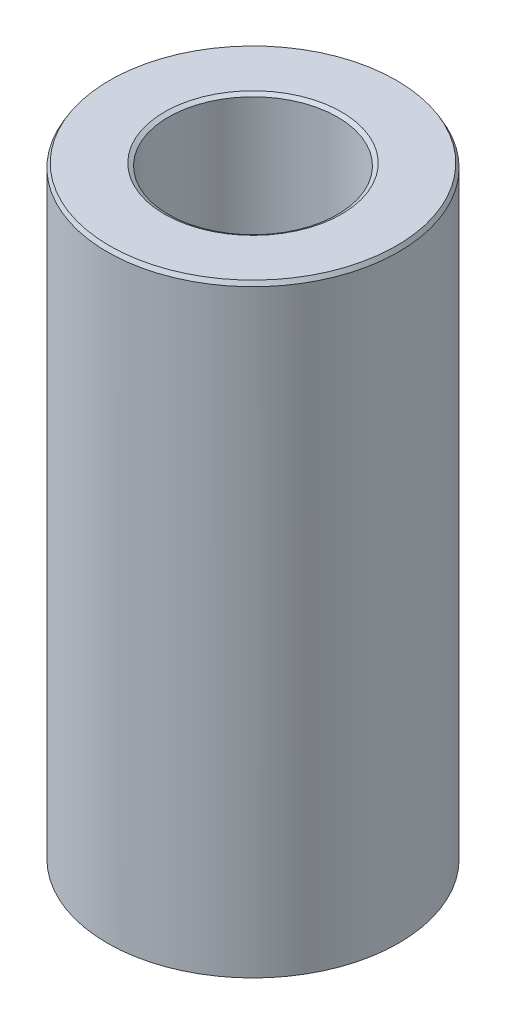
ISO-10303-21;
HEADER;
FILE_DESCRIPTION(('STEP AP214'),'2;1');
FILE_NAME('part.step','',(''),(''),'','','');
FILE_SCHEMA(('AUTOMOTIVE_DESIGN { 1 0 10303 214 1 1 1 1 }'));
ENDSEC;
DATA;
#1=APPLICATION_CONTEXT('core data for automotive mechanical design processes');
#2=APPLICATION_PROTOCOL_DEFINITION('international standard','automotive_design',2000,#1);
#3=PRODUCT_CONTEXT('',#1,'mechanical');
#4=PRODUCT('Part','Part','',(#3));
#5=PRODUCT_RELATED_PRODUCT_CATEGORY('part','',(#4));
#6=PRODUCT_DEFINITION_FORMATION('','',#4);
#7=PRODUCT_DEFINITION_CONTEXT('part definition',#1,'design');
#8=PRODUCT_DEFINITION('design','',#6,#7);
#9=PRODUCT_DEFINITION_SHAPE('','',#8);
#10=(LENGTH_UNIT() NAMED_UNIT(*) SI_UNIT(.MILLI.,.METRE.));
#11=(NAMED_UNIT(*) PLANE_ANGLE_UNIT() SI_UNIT($,.RADIAN.));
#12=(NAMED_UNIT(*) SI_UNIT($,.STERADIAN.) SOLID_ANGLE_UNIT());
#13=UNCERTAINTY_MEASURE_WITH_UNIT(LENGTH_MEASURE(1.E-05),#10,'distance_accuracy_value','');
#14=(GEOMETRIC_REPRESENTATION_CONTEXT(3) GLOBAL_UNCERTAINTY_ASSIGNED_CONTEXT((#13)) GLOBAL_UNIT_ASSIGNED_CONTEXT((#10,
#11,#12)) REPRESENTATION_CONTEXT('',''));
#15=CARTESIAN_POINT('',(0.,0.,0.));
#16=DIRECTION('',(0.,0.,1.));
#17=DIRECTION('',(1.,0.,0.));
#18=AXIS2_PLACEMENT_3D('',#15,#16,#17);
#19=CARTESIAN_POINT('',(0.,166.058418449914,0.));
#20=DIRECTION('',(0.,-1.,0.));
#21=DIRECTION('',(0.,0.,-1.));
#22=AXIS2_PLACEMENT_3D('',#19,#20,#21);
#23=CYLINDRICAL_SURFACE('',#22,40.);
#24=CARTESIAN_POINT('',(0.,0.644402574227404,0.));
#25=DIRECTION('',(0.,1.,0.));
#26=DIRECTION('',(0.,0.,1.));
#27=AXIS2_PLACEMENT_3D('',#24,#25,#26);
#28=CIRCLE('',#27,40.);
#29=CARTESIAN_POINT('',(0.,0.644402574227404,-40.));
#30=VERTEX_POINT('',#29);
#31=EDGE_CURVE('E10',#30,#30,#28,.T.);
#32=CARTESIAN_POINT('',(0.,164.942280450824,0.));
#33=DIRECTION('',(0.,1.,0.));
#34=DIRECTION('',(0.,0.,1.));
#35=AXIS2_PLACEMENT_3D('',#32,#33,#34);
#36=CIRCLE('',#35,40.);
#37=CARTESIAN_POINT('',(0.,164.942280450824,-40.));
#38=VERTEX_POINT('',#37);
#39=EDGE_CURVE('E50',#38,#38,#36,.F.);
#40=CARTESIAN_POINT('',(0.,0.644402574227404,-40.));
#41=CARTESIAN_POINT('',(0.,2.35583880210862,-40.));
#42=CARTESIAN_POINT('',(0.,4.06727502998984,-40.));
#43=CARTESIAN_POINT('',(0.,7.49014748575227,-40.));
#44=CARTESIAN_POINT('',(0.,9.2015837136335,-40.));
#45=CARTESIAN_POINT('',(0.,12.6244561693959,-40.));
#46=CARTESIAN_POINT('',(0.,14.3358923972772,-40.));
#47=CARTESIAN_POINT('',(0.,17.7587648530396,-40.));
#48=CARTESIAN_POINT('',(0.,19.4702010809208,-40.));
#49=CARTESIAN_POINT('',(0.,22.8930735366832,-40.));
#50=CARTESIAN_POINT('',(0.,24.6045097645644,-40.));
#51=CARTESIAN_POINT('',(0.,28.0273822203269,-40.));
#52=CARTESIAN_POINT('',(0.,29.7388184482081,-40.));
#53=CARTESIAN_POINT('',(0.,33.1616909039706,-40.));
#54=CARTESIAN_POINT('',(0.,34.8731271318518,-40.));
#55=CARTESIAN_POINT('',(0.,38.2959995876142,-40.));
#56=CARTESIAN_POINT('',(0.,40.0074358154954,-40.));
#57=CARTESIAN_POINT('',(0.,43.4303082712578,-40.));
#58=CARTESIAN_POINT('',(0.,45.1417444991391,-40.));
#59=CARTESIAN_POINT('',(0.,48.5646169549015,-40.));
#60=CARTESIAN_POINT('',(0.,50.2760531827827,-40.));
#61=CARTESIAN_POINT('',(0.,53.6989256385451,-40.));
#62=CARTESIAN_POINT('',(0.,55.4103618664264,-40.));
#63=CARTESIAN_POINT('',(0.,58.8332343221888,-40.));
#64=CARTESIAN_POINT('',(0.,60.54467055007,-40.));
#65=CARTESIAN_POINT('',(0.,63.9675430058324,-40.));
#66=CARTESIAN_POINT('',(0.,65.6789792337137,-40.));
#67=CARTESIAN_POINT('',(0.,69.1018516894761,-40.));
#68=CARTESIAN_POINT('',(0.,70.8132879173573,-40.));
#69=CARTESIAN_POINT('',(0.,74.2361603731198,-40.));
#70=CARTESIAN_POINT('',(0.,75.947596601001,-40.));
#71=CARTESIAN_POINT('',(0.,79.3704690567634,-40.));
#72=CARTESIAN_POINT('',(0.,81.0819052846446,-40.));
#73=CARTESIAN_POINT('',(0.,84.5047777404071,-40.));
#74=CARTESIAN_POINT('',(0.,86.2162139682883,-40.));
#75=CARTESIAN_POINT('',(0.,89.6390864240507,-40.));
#76=CARTESIAN_POINT('',(0.,91.3505226519319,-40.));
#77=CARTESIAN_POINT('',(0.,94.7733951076944,-40.));
#78=CARTESIAN_POINT('',(0.,96.4848313355756,-40.));
#79=CARTESIAN_POINT('',(0.,99.907703791338,-40.));
#80=CARTESIAN_POINT('',(0.,101.619140019219,-40.));
#81=CARTESIAN_POINT('',(0.,105.042012474982,-40.));
#82=CARTESIAN_POINT('',(0.,106.753448702863,-40.));
#83=CARTESIAN_POINT('',(0.,110.176321158625,-40.));
#84=CARTESIAN_POINT('',(0.,111.887757386507,-40.));
#85=CARTESIAN_POINT('',(0.,115.310629842269,-40.));
#86=CARTESIAN_POINT('',(0.,117.02206607015,-40.));
#87=CARTESIAN_POINT('',(0.,120.444938525913,-40.));
#88=CARTESIAN_POINT('',(0.,122.156374753794,-40.));
#89=CARTESIAN_POINT('',(0.,125.579247209556,-40.));
#90=CARTESIAN_POINT('',(0.,127.290683437437,-40.));
#91=CARTESIAN_POINT('',(0.,130.7135558932,-40.));
#92=CARTESIAN_POINT('',(0.,132.424992121081,-40.));
#93=CARTESIAN_POINT('',(0.,135.847864576844,-40.));
#94=CARTESIAN_POINT('',(0.,137.559300804725,-40.));
#95=CARTESIAN_POINT('',(0.,140.982173260487,-40.));
#96=CARTESIAN_POINT('',(0.,142.693609488368,-40.));
#97=CARTESIAN_POINT('',(0.,146.116481944131,-40.));
#98=CARTESIAN_POINT('',(0.,147.827918172012,-40.));
#99=CARTESIAN_POINT('',(0.,151.250790627775,-40.));
#100=CARTESIAN_POINT('',(0.,152.962226855656,-40.));
#101=CARTESIAN_POINT('',(0.,156.385099311418,-40.));
#102=CARTESIAN_POINT('',(0.,158.096535539299,-40.));
#103=CARTESIAN_POINT('',(0.,161.519407995062,-40.));
#104=CARTESIAN_POINT('',(0.,163.230844222943,-40.));
#105=CARTESIAN_POINT('',(0.,164.942280450824,-40.));
#106=B_SPLINE_CURVE_WITH_KNOTS('',3,(#40,#41,#42,#43,#44,#45,#46,#47,#48,#49,#50,#51,#52,#53,
#54,#55,#56,#57,#58,#59,#60,#61,#62,#63,#64,#65,#66,#67,#68,#69,#70,#71,#72,#73,#74,#75,#76,#77,
#78,#79,#80,#81,#82,#83,#84,#85,#86,#87,#88,#89,#90,#91,#92,#93,#94,#95,#96,#97,#98,#99,#100,
#101,#102,#103,#104,#105),.UNSPECIFIED.,.F.,.F.,(4,2,2,2,2,2,2,2,2,2,2,2,2,2,2,2,2,2,2,2,2,2,2,
2,2,2,2,2,2,2,2,2,4),(0.,5.13430868364365,10.2686173672873,15.402926050931,20.5372347345746,
25.6715434182183,30.8058521018619,35.9401607855056,41.0744694691492,46.2087781527929,
51.3430868364365,56.4773955200802,61.6117042037238,66.7460128873675,71.8803215710111,
77.0146302546548,82.1489389382984,87.2832476219421,92.4175563055857,97.5518649892294,
102.686173672873,107.820482356517,112.95479104016,118.089099723804,123.223408407448,
128.357717091091,133.492025774735,138.626334458379,143.760643142022,148.894951825666,
154.02926050931,159.163569192953,164.297877876597),.UNSPECIFIED.);
#107=EDGE_CURVE('BSEAM39',#30,#38,#106,.T.);
#108=ORIENTED_EDGE('',*,*,#31,.T.);
#109=ORIENTED_EDGE('',*,*,#39,.T.);
#110=ORIENTED_EDGE('',*,*,#107,.T.);
#111=ORIENTED_EDGE('',*,*,#107,.F.);
#112=EDGE_LOOP('',(#108,#110,#109,#111));
#113=FACE_BOUND('',#112,.T.);
#114=ADVANCED_FACE('F39',(#113),#23,.T.);
#115=CARTESIAN_POINT('',(0.,166.058418449914,0.));
#116=DIRECTION('',(0.,1.,0.));
#117=DIRECTION('',(0.,0.,1.));
#118=AXIS2_PLACEMENT_3D('',#115,#116,#117);
#119=PLANE('',#118);
#120=CARTESIAN_POINT('',(0.,166.058418449914,0.));
#121=DIRECTION('',(0.,1.,0.));
#122=DIRECTION('',(0.,0.,1.));
#123=AXIS2_PLACEMENT_3D('',#120,#121,#122);
#124=CIRCLE('',#123,24.3085651649166);
#125=CARTESIAN_POINT('',(0.,166.058418449914,24.3085651649166));
#126=VERTEX_POINT('',#125);
#127=EDGE_CURVE('E58',#126,#126,#124,.F.);
#128=ORIENTED_EDGE('',*,*,#127,.T.);
#129=EDGE_LOOP('',(#128));
#130=FACE_BOUND('',#129,.T.);
#131=CARTESIAN_POINT('',(0.,166.058418449914,0.));
#132=DIRECTION('',(0.,1.,0.));
#133=DIRECTION('',(0.,0.,1.));
#134=AXIS2_PLACEMENT_3D('',#131,#132,#133);
#135=CIRCLE('',#134,39.3555974257728);
#136=CARTESIAN_POINT('',(0.,166.058418449914,39.3555974257728));
#137=VERTEX_POINT('',#136);
#138=EDGE_CURVE('E61',#137,#137,#135,.T.);
#139=ORIENTED_EDGE('',*,*,#138,.T.);
#140=EDGE_LOOP('',(#139));
#141=FACE_BOUND('',#140,.T.);
#142=ADVANCED_FACE('F88',(#130,#141),#119,.T.);
#143=CARTESIAN_POINT('',(0.,0.,0.));
#144=DIRECTION('',(0.,1.,0.));
#145=DIRECTION('',(0.,0.,1.));
#146=AXIS2_PLACEMENT_3D('',#143,#144,#145);
#147=PLANE('',#146);
#148=CARTESIAN_POINT('',(0.,0.,0.));
#149=DIRECTION('',(0.,1.,0.));
#150=DIRECTION('',(0.,0.,1.));
#151=AXIS2_PLACEMENT_3D('',#148,#149,#150);
#152=CIRCLE('',#151,23.8368297400539);
#153=CARTESIAN_POINT('',(0.,0.,23.8368297400539));
#154=VERTEX_POINT('',#153);
#155=EDGE_CURVE('E51',#154,#154,#152,.T.);
#156=ORIENTED_EDGE('',*,*,#155,.T.);
#157=EDGE_LOOP('',(#156));
#158=FACE_BOUND('',#157,.T.);
#159=CARTESIAN_POINT('',(0.,0.,0.));
#160=DIRECTION('',(0.,1.,0.));
#161=DIRECTION('',(0.,0.,1.));
#162=AXIS2_PLACEMENT_3D('',#159,#160,#161);
#163=CIRCLE('',#162,38.88386200091);
#164=CARTESIAN_POINT('',(0.,0.,38.88386200091));
#165=VERTEX_POINT('',#164);
#166=EDGE_CURVE('E54',#165,#165,#163,.F.);
#167=ORIENTED_EDGE('',*,*,#166,.T.);
#168=EDGE_LOOP('',(#167));
#169=FACE_BOUND('',#168,.T.);
#170=ADVANCED_FACE('F83',(#158,#169),#147,.F.);
#171=CARTESIAN_POINT('',(0.,166.058418449914,0.));
#172=DIRECTION('',(0.,-1.,0.));
#173=DIRECTION('',(0.,0.,-1.));
#174=AXIS2_PLACEMENT_3D('',#171,#172,#173);
#175=CYLINDRICAL_SURFACE('',#174,23.1924271658265);
#176=CARTESIAN_POINT('',(0.,165.414015875687,0.));
#177=DIRECTION('',(0.,1.,0.));
#178=DIRECTION('',(0.,0.,1.));
#179=AXIS2_PLACEMENT_3D('',#176,#177,#178);
#180=CIRCLE('',#179,23.1924271658265);
#181=CARTESIAN_POINT('',(0.,165.414015875687,-23.1924271658265));
#182=VERTEX_POINT('',#181);
#183=EDGE_CURVE('E67',#182,#182,#180,.T.);
#184=CARTESIAN_POINT('',(0.,1.11613799908991,0.));
#185=DIRECTION('',(0.,1.,0.));
#186=DIRECTION('',(0.,0.,1.));
#187=AXIS2_PLACEMENT_3D('',#184,#185,#186);
#188=CIRCLE('',#187,23.1924271658265);
#189=CARTESIAN_POINT('',(0.,1.11613799908991,-23.1924271658265));
#190=VERTEX_POINT('',#189);
#191=EDGE_CURVE('E69',#190,#190,#188,.F.);
#192=CARTESIAN_POINT('',(0.,165.414015875687,-23.1924271658265));
#193=CARTESIAN_POINT('',(0.,163.702579647805,-23.1924271658265));
#194=CARTESIAN_POINT('',(0.,161.991143419924,-23.1924271658265));
#195=CARTESIAN_POINT('',(0.,158.568270964162,-23.1924271658265));
#196=CARTESIAN_POINT('',(0.,156.856834736281,-23.1924271658265));
#197=CARTESIAN_POINT('',(0.,153.433962280518,-23.1924271658265));
#198=CARTESIAN_POINT('',(0.,151.722526052637,-23.1924271658265));
#199=CARTESIAN_POINT('',(0.,148.299653596874,-23.1924271658265));
#200=CARTESIAN_POINT('',(0.,146.588217368993,-23.1924271658265));
#201=CARTESIAN_POINT('',(0.,143.165344913231,-23.1924271658265));
#202=CARTESIAN_POINT('',(0.,141.45390868535,-23.1924271658265));
#203=CARTESIAN_POINT('',(0.,138.031036229587,-23.1924271658265));
#204=CARTESIAN_POINT('',(0.,136.319600001706,-23.1924271658265));
#205=CARTESIAN_POINT('',(0.,132.896727545944,-23.1924271658265));
#206=CARTESIAN_POINT('',(0.,131.185291318062,-23.1924271658265));
#207=CARTESIAN_POINT('',(0.,127.7624188623,-23.1924271658265));
#208=CARTESIAN_POINT('',(0.,126.050982634419,-23.1924271658265));
#209=CARTESIAN_POINT('',(0.,122.628110178656,-23.1924271658265));
#210=CARTESIAN_POINT('',(0.,120.916673950775,-23.1924271658265));
#211=CARTESIAN_POINT('',(0.,117.493801495013,-23.1924271658265));
#212=CARTESIAN_POINT('',(0.,115.782365267131,-23.1924271658265));
#213=CARTESIAN_POINT('',(0.,112.359492811369,-23.1924271658265));
#214=CARTESIAN_POINT('',(0.,110.648056583488,-23.1924271658265));
#215=CARTESIAN_POINT('',(0.,107.225184127725,-23.1924271658265));
#216=CARTESIAN_POINT('',(0.,105.513747899844,-23.1924271658265));
#217=CARTESIAN_POINT('',(0.,102.090875444082,-23.1924271658265));
#218=CARTESIAN_POINT('',(0.,100.3794392162,-23.1924271658265));
#219=CARTESIAN_POINT('',(0.,96.956566760438,-23.1924271658265));
#220=CARTESIAN_POINT('',(0.,95.2451305325568,-23.1924271658265));
#221=CARTESIAN_POINT('',(0.,91.8222580767944,-23.1924271658265));
#222=CARTESIAN_POINT('',(0.,90.1108218489131,-23.1924271658265));
#223=CARTESIAN_POINT('',(0.,86.6879493931507,-23.1924271658265));
#224=CARTESIAN_POINT('',(0.,84.9765131652695,-23.1924271658265));
#225=CARTESIAN_POINT('',(0.,81.5536407095071,-23.1924271658265));
#226=CARTESIAN_POINT('',(0.,79.8422044816259,-23.1924271658265));
#227=CARTESIAN_POINT('',(0.,76.4193320258634,-23.1924271658265));
#228=CARTESIAN_POINT('',(0.,74.7078957979822,-23.1924271658265));
#229=CARTESIAN_POINT('',(0.,71.2850233422198,-23.1924271658265));
#230=CARTESIAN_POINT('',(0.,69.5735871143386,-23.1924271658265));
#231=CARTESIAN_POINT('',(0.,66.1507146585761,-23.1924271658265));
#232=CARTESIAN_POINT('',(0.,64.4392784306949,-23.1924271658265));
#233=CARTESIAN_POINT('',(0.,61.0164059749325,-23.1924271658265));
#234=CARTESIAN_POINT('',(0.,59.3049697470513,-23.1924271658265));
#235=CARTESIAN_POINT('',(0.,55.8820972912888,-23.1924271658265));
#236=CARTESIAN_POINT('',(0.,54.1706610634076,-23.1924271658265));
#237=CARTESIAN_POINT('',(0.,50.7477886076452,-23.1924271658265));
#238=CARTESIAN_POINT('',(0.,49.036352379764,-23.1924271658265));
#239=CARTESIAN_POINT('',(0.,45.6134799240015,-23.1924271658265));
#240=CARTESIAN_POINT('',(0.,43.9020436961203,-23.1924271658265));
#241=CARTESIAN_POINT('',(0.,40.4791712403579,-23.1924271658265));
#242=CARTESIAN_POINT('',(0.,38.7677350124767,-23.1924271658265));
#243=CARTESIAN_POINT('',(0.,35.3448625567142,-23.1924271658265));
#244=CARTESIAN_POINT('',(0.,33.633426328833,-23.1924271658265));
#245=CARTESIAN_POINT('',(0.,30.2105538730706,-23.1924271658265));
#246=CARTESIAN_POINT('',(0.,28.4991176451894,-23.1924271658265));
#247=CARTESIAN_POINT('',(0.,25.0762451894269,-23.1924271658265));
#248=CARTESIAN_POINT('',(0.,23.3648089615457,-23.1924271658265));
#249=CARTESIAN_POINT('',(0.,19.9419365057833,-23.1924271658265));
#250=CARTESIAN_POINT('',(0.,18.2305002779021,-23.1924271658265));
#251=CARTESIAN_POINT('',(0.,14.8076278221396,-23.1924271658265));
#252=CARTESIAN_POINT('',(0.,13.0961915942584,-23.1924271658265));
#253=CARTESIAN_POINT('',(0.,9.67331913849599,-23.1924271658265));
#254=CARTESIAN_POINT('',(0.,7.96188291061477,-23.1924271658265));
#255=CARTESIAN_POINT('',(0.,4.53901045485234,-23.1924271658265));
#256=CARTESIAN_POINT('',(0.,2.82757422697113,-23.1924271658265));
#257=CARTESIAN_POINT('',(0.,1.11613799908991,-23.1924271658265));
#258=B_SPLINE_CURVE_WITH_KNOTS('',3,(#192,#193,#194,#195,#196,#197,#198,#199,#200,#201,#202,
#203,#204,#205,#206,#207,#208,#209,#210,#211,#212,#213,#214,#215,#216,#217,#218,#219,#220,#221,
#222,#223,#224,#225,#226,#227,#228,#229,#230,#231,#232,#233,#234,#235,#236,#237,#238,#239,#240,
#241,#242,#243,#244,#245,#246,#247,#248,#249,#250,#251,#252,#253,#254,#255,#256,#257),
.UNSPECIFIED.,.F.,.F.,(4,2,2,2,2,2,2,2,2,2,2,2,2,2,2,2,2,2,2,2,2,2,2,2,2,2,2,2,2,2,2,2,4),(0.,
5.13430868364365,10.2686173672873,15.4029260509309,20.5372347345746,25.6715434182182,
30.8058521018619,35.9401607855055,41.0744694691492,46.2087781527928,51.3430868364365,
56.4773955200801,61.6117042037237,66.7460128873674,71.8803215710111,77.0146302546547,
82.1489389382983,87.283247621942,92.4175563055856,97.5518649892293,102.686173672873,
107.820482356517,112.95479104016,118.089099723804,123.223408407448,128.357717091091,
133.492025774735,138.626334458378,143.760643142022,148.894951825666,154.029260509309,
159.163569192953,164.297877876597),.UNSPECIFIED.);
#259=EDGE_CURVE('BSEAM71',#182,#190,#258,.T.);
#260=ORIENTED_EDGE('',*,*,#183,.T.);
#261=ORIENTED_EDGE('',*,*,#191,.T.);
#262=ORIENTED_EDGE('',*,*,#259,.T.);
#263=ORIENTED_EDGE('',*,*,#259,.F.);
#264=EDGE_LOOP('',(#260,#262,#261,#263));
#265=FACE_BOUND('',#264,.T.);
#266=ADVANCED_FACE('F71',(#265),#175,.F.);
#267=CARTESIAN_POINT('',(0.,165.414015875687,0.));
#268=DIRECTION('',(0.,1.,0.));
#269=DIRECTION('',(0.,0.,1.));
#270=AXIS2_PLACEMENT_3D('',#267,#268,#269);
#271=CONICAL_SURFACE('',#270,23.1924271658265,1.04719755119658);
#272=ORIENTED_EDGE('',*,*,#127,.F.);
#273=EDGE_LOOP('',(#272));
#274=FACE_BOUND('',#273,.T.);
#275=ORIENTED_EDGE('',*,*,#183,.F.);
#276=EDGE_LOOP('',(#275));
#277=FACE_BOUND('',#276,.T.);
#278=ADVANCED_FACE('F77',(#274,#277),#271,.F.);
#279=CARTESIAN_POINT('',(0.,0.,0.));
#280=DIRECTION('',(0.,-1.,0.));
#281=DIRECTION('',(0.,0.,-1.));
#282=AXIS2_PLACEMENT_3D('',#279,#280,#281);
#283=CONICAL_SURFACE('',#282,23.8368297400539,0.523598775598297);
#284=ORIENTED_EDGE('',*,*,#191,.F.);
#285=EDGE_LOOP('',(#284));
#286=FACE_BOUND('',#285,.T.);
#287=ORIENTED_EDGE('',*,*,#155,.F.);
#288=EDGE_LOOP('',(#287));
#289=FACE_BOUND('',#288,.T.);
#290=ADVANCED_FACE('F73',(#286,#289),#283,.F.);
#291=CARTESIAN_POINT('',(0.,0.644402574227404,0.));
#292=DIRECTION('',(0.,1.,0.));
#293=DIRECTION('',(0.,0.,1.));
#294=AXIS2_PLACEMENT_3D('',#291,#292,#293);
#295=CONICAL_SURFACE('',#294,40.,1.0471975511966);
#296=ORIENTED_EDGE('',*,*,#166,.F.);
#297=EDGE_LOOP('',(#296));
#298=FACE_BOUND('',#297,.T.);
#299=ORIENTED_EDGE('',*,*,#31,.F.);
#300=EDGE_LOOP('',(#299));
#301=FACE_BOUND('',#300,.T.);
#302=ADVANCED_FACE('F76',(#298,#301),#295,.T.);
#303=CARTESIAN_POINT('',(0.,166.058418449914,0.));
#304=DIRECTION('',(0.,-1.,0.));
#305=DIRECTION('',(0.,0.,-1.));
#306=AXIS2_PLACEMENT_3D('',#303,#304,#305);
#307=CONICAL_SURFACE('',#306,39.3555974257728,0.523598775598285);
#308=ORIENTED_EDGE('',*,*,#39,.F.);
#309=EDGE_LOOP('',(#308));
#310=FACE_BOUND('',#309,.T.);
#311=ORIENTED_EDGE('',*,*,#138,.F.);
#312=EDGE_LOOP('',(#311));
#313=FACE_BOUND('',#312,.T.);
#314=ADVANCED_FACE('F45',(#310,#313),#307,.T.);
#315=CLOSED_SHELL('',(#114,#142,#170,#266,#278,#290,#302,#314));
#316=MANIFOLD_SOLID_BREP('B2',#315);
#317=ADVANCED_BREP_SHAPE_REPRESENTATION('',(#18,#316),#14);
#318=SHAPE_DEFINITION_REPRESENTATION(#9,#317);
ENDSEC;
END-ISO-10303-21;
